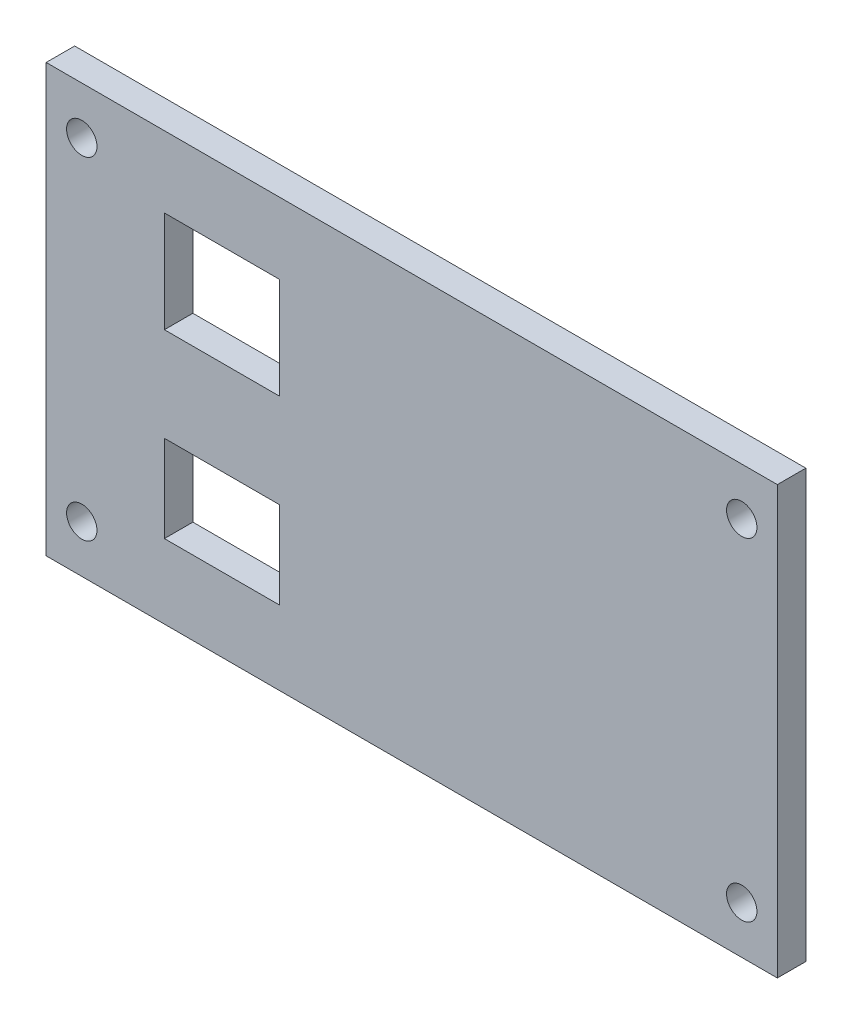
ISO-10303-21;
HEADER;
FILE_DESCRIPTION(('STEP AP214'),'2;1');
FILE_NAME('part.step','',(''),(''),'','','');
FILE_SCHEMA(('AUTOMOTIVE_DESIGN { 1 0 10303 214 1 1 1 1 }'));
ENDSEC;
DATA;
#1=APPLICATION_CONTEXT('core data for automotive mechanical design processes');
#2=APPLICATION_PROTOCOL_DEFINITION('international standard','automotive_design',2000,#1);
#3=PRODUCT_CONTEXT('',#1,'mechanical');
#4=PRODUCT('Part','Part','',(#3));
#5=PRODUCT_RELATED_PRODUCT_CATEGORY('part','',(#4));
#6=PRODUCT_DEFINITION_FORMATION('','',#4);
#7=PRODUCT_DEFINITION_CONTEXT('part definition',#1,'design');
#8=PRODUCT_DEFINITION('design','',#6,#7);
#9=PRODUCT_DEFINITION_SHAPE('','',#8);
#10=(LENGTH_UNIT() NAMED_UNIT(*) SI_UNIT(.MILLI.,.METRE.));
#11=(NAMED_UNIT(*) PLANE_ANGLE_UNIT() SI_UNIT($,.RADIAN.));
#12=(NAMED_UNIT(*) SI_UNIT($,.STERADIAN.) SOLID_ANGLE_UNIT());
#13=UNCERTAINTY_MEASURE_WITH_UNIT(LENGTH_MEASURE(1.E-05),#10,'distance_accuracy_value','');
#14=(GEOMETRIC_REPRESENTATION_CONTEXT(3) GLOBAL_UNCERTAINTY_ASSIGNED_CONTEXT((#13)) GLOBAL_UNIT_ASSIGNED_CONTEXT((#10,
#11,#12)) REPRESENTATION_CONTEXT('',''));
#15=CARTESIAN_POINT('',(0.,0.,0.));
#16=DIRECTION('',(0.,0.,1.));
#17=DIRECTION('',(1.,0.,0.));
#18=AXIS2_PLACEMENT_3D('',#15,#16,#17);
#19=CARTESIAN_POINT('',(-38.5,-22.5,3.));
#20=DIRECTION('',(1.,0.,0.));
#21=DIRECTION('',(0.,0.,-1.));
#22=AXIS2_PLACEMENT_3D('',#19,#20,#21);
#23=PLANE('',#22);
#24=DIRECTION('',(0.,-1.,0.));
#25=VECTOR('',#24,1.);
#26=CARTESIAN_POINT('',(-38.5,-22.5,0.));
#27=LINE('',#26,#25);
#28=CARTESIAN_POINT('',(-38.5,22.5,0.));
#29=VERTEX_POINT('',#28);
#30=CARTESIAN_POINT('',(-38.5,-22.5,0.));
#31=VERTEX_POINT('',#30);
#32=EDGE_CURVE('E186',#29,#31,#27,.T.);
#33=ORIENTED_EDGE('',*,*,#32,.T.);
#34=DIRECTION('',(0.,0.,-1.));
#35=VECTOR('',#34,1.);
#36=CARTESIAN_POINT('',(-38.5,-22.5,3.));
#37=LINE('',#36,#35);
#38=CARTESIAN_POINT('',(-38.5,-22.5,3.));
#39=VERTEX_POINT('',#38);
#40=EDGE_CURVE('E11',#39,#31,#37,.T.);
#41=ORIENTED_EDGE('',*,*,#40,.F.);
#42=DIRECTION('',(0.,-1.,0.));
#43=VECTOR('',#42,1.);
#44=CARTESIAN_POINT('',(-38.5,-22.5,3.));
#45=LINE('',#44,#43);
#46=CARTESIAN_POINT('',(-38.5,22.5,3.));
#47=VERTEX_POINT('',#46);
#48=EDGE_CURVE('E187',#47,#39,#45,.T.);
#49=ORIENTED_EDGE('',*,*,#48,.F.);
#50=DIRECTION('',(0.,0.,-1.));
#51=VECTOR('',#50,1.);
#52=CARTESIAN_POINT('',(-38.5,22.5,3.));
#53=LINE('',#52,#51);
#54=EDGE_CURVE('E197',#47,#29,#53,.T.);
#55=ORIENTED_EDGE('',*,*,#54,.T.);
#56=EDGE_LOOP('',(#33,#41,#49,#55));
#57=FACE_BOUND('',#56,.T.);
#58=ADVANCED_FACE('F32',(#57),#23,.F.);
#59=CARTESIAN_POINT('',(38.5,-22.5,3.));
#60=DIRECTION('',(0.,1.,0.));
#61=DIRECTION('',(-1.,0.,0.));
#62=AXIS2_PLACEMENT_3D('',#59,#60,#61);
#63=PLANE('',#62);
#64=DIRECTION('',(1.,0.,0.));
#65=VECTOR('',#64,1.);
#66=CARTESIAN_POINT('',(38.5,-22.5,0.));
#67=LINE('',#66,#65);
#68=CARTESIAN_POINT('',(38.5,-22.5,0.));
#69=VERTEX_POINT('',#68);
#70=EDGE_CURVE('E200',#31,#69,#67,.T.);
#71=ORIENTED_EDGE('',*,*,#70,.T.);
#72=DIRECTION('',(0.,0.,-1.));
#73=VECTOR('',#72,1.);
#74=CARTESIAN_POINT('',(38.5,-22.5,3.));
#75=LINE('',#74,#73);
#76=CARTESIAN_POINT('',(38.5,-22.5,3.));
#77=VERTEX_POINT('',#76);
#78=EDGE_CURVE('E39',#77,#69,#75,.T.);
#79=ORIENTED_EDGE('',*,*,#78,.F.);
#80=DIRECTION('',(1.,0.,0.));
#81=VECTOR('',#80,1.);
#82=CARTESIAN_POINT('',(38.5,-22.5,3.));
#83=LINE('',#82,#81);
#84=EDGE_CURVE('E190',#39,#77,#83,.T.);
#85=ORIENTED_EDGE('',*,*,#84,.F.);
#86=ORIENTED_EDGE('',*,*,#40,.T.);
#87=EDGE_LOOP('',(#71,#79,#85,#86));
#88=FACE_BOUND('',#87,.T.);
#89=ADVANCED_FACE('F229',(#88),#63,.F.);
#90=CARTESIAN_POINT('',(38.5,-22.5,3.));
#91=DIRECTION('',(-1.,0.,0.));
#92=DIRECTION('',(0.,0.,1.));
#93=AXIS2_PLACEMENT_3D('',#90,#91,#92);
#94=PLANE('',#93);
#95=DIRECTION('',(0.,1.,0.));
#96=VECTOR('',#95,1.);
#97=CARTESIAN_POINT('',(38.5,-22.5,0.));
#98=LINE('',#97,#96);
#99=CARTESIAN_POINT('',(38.5,22.5,0.));
#100=VERTEX_POINT('',#99);
#101=EDGE_CURVE('E202',#69,#100,#98,.T.);
#102=ORIENTED_EDGE('',*,*,#101,.T.);
#103=DIRECTION('',(0.,0.,-1.));
#104=VECTOR('',#103,1.);
#105=CARTESIAN_POINT('',(38.5,22.5,3.));
#106=LINE('',#105,#104);
#107=CARTESIAN_POINT('',(38.5,22.5,3.));
#108=VERTEX_POINT('',#107);
#109=EDGE_CURVE('E207',#108,#100,#106,.T.);
#110=ORIENTED_EDGE('',*,*,#109,.F.);
#111=DIRECTION('',(0.,1.,0.));
#112=VECTOR('',#111,1.);
#113=CARTESIAN_POINT('',(38.5,-22.5,3.));
#114=LINE('',#113,#112);
#115=EDGE_CURVE('E193',#77,#108,#114,.T.);
#116=ORIENTED_EDGE('',*,*,#115,.F.);
#117=ORIENTED_EDGE('',*,*,#78,.T.);
#118=EDGE_LOOP('',(#102,#110,#116,#117));
#119=FACE_BOUND('',#118,.T.);
#120=ADVANCED_FACE('F214',(#119),#94,.F.);
#121=CARTESIAN_POINT('',(38.5,22.5,3.));
#122=DIRECTION('',(0.,-1.,0.));
#123=DIRECTION('',(1.,0.,0.));
#124=AXIS2_PLACEMENT_3D('',#121,#122,#123);
#125=PLANE('',#124);
#126=DIRECTION('',(-1.,0.,0.));
#127=VECTOR('',#126,1.);
#128=CARTESIAN_POINT('',(38.5,22.5,0.));
#129=LINE('',#128,#127);
#130=EDGE_CURVE('E191',#100,#29,#129,.T.);
#131=ORIENTED_EDGE('',*,*,#130,.T.);
#132=ORIENTED_EDGE('',*,*,#54,.F.);
#133=DIRECTION('',(-1.,0.,0.));
#134=VECTOR('',#133,1.);
#135=CARTESIAN_POINT('',(38.5,22.5,3.));
#136=LINE('',#135,#134);
#137=EDGE_CURVE('E195',#108,#47,#136,.T.);
#138=ORIENTED_EDGE('',*,*,#137,.F.);
#139=ORIENTED_EDGE('',*,*,#109,.T.);
#140=EDGE_LOOP('',(#131,#132,#138,#139));
#141=FACE_BOUND('',#140,.T.);
#142=ADVANCED_FACE('F223',(#141),#125,.F.);
#143=CARTESIAN_POINT('',(-38.5,22.5,3.));
#144=DIRECTION('',(0.,0.,1.));
#145=DIRECTION('',(1.,0.,0.));
#146=AXIS2_PLACEMENT_3D('',#143,#144,#145);
#147=PLANE('',#146);
#148=CARTESIAN_POINT('',(-34.75,-17.5,3.));
#149=DIRECTION('',(0.,0.,1.));
#150=DIRECTION('',(1.,0.,0.));
#151=AXIS2_PLACEMENT_3D('',#148,#149,#150);
#152=CIRCLE('',#151,1.6);
#153=CARTESIAN_POINT('',(-33.15,-17.5,3.));
#154=VERTEX_POINT('',#153);
#155=EDGE_CURVE('E293',#154,#154,#152,.F.);
#156=ORIENTED_EDGE('',*,*,#155,.T.);
#157=EDGE_LOOP('',(#156));
#158=FACE_BOUND('',#157,.T.);
#159=CARTESIAN_POINT('',(34.75,-17.5,3.));
#160=DIRECTION('',(0.,0.,1.));
#161=DIRECTION('',(1.,0.,0.));
#162=AXIS2_PLACEMENT_3D('',#159,#160,#161);
#163=CIRCLE('',#162,1.6);
#164=CARTESIAN_POINT('',(36.35,-17.5,3.));
#165=VERTEX_POINT('',#164);
#166=EDGE_CURVE('E297',#165,#165,#163,.F.);
#167=ORIENTED_EDGE('',*,*,#166,.T.);
#168=EDGE_LOOP('',(#167));
#169=FACE_BOUND('',#168,.T.);
#170=CARTESIAN_POINT('',(34.75,17.5,3.));
#171=DIRECTION('',(0.,0.,1.));
#172=DIRECTION('',(1.,0.,0.));
#173=AXIS2_PLACEMENT_3D('',#170,#171,#172);
#174=CIRCLE('',#173,1.6);
#175=CARTESIAN_POINT('',(36.35,17.5,3.));
#176=VERTEX_POINT('',#175);
#177=EDGE_CURVE('E305',#176,#176,#174,.F.);
#178=ORIENTED_EDGE('',*,*,#177,.T.);
#179=EDGE_LOOP('',(#178));
#180=FACE_BOUND('',#179,.T.);
#181=CARTESIAN_POINT('',(-34.75,17.5,3.));
#182=DIRECTION('',(0.,0.,1.));
#183=DIRECTION('',(1.,0.,0.));
#184=AXIS2_PLACEMENT_3D('',#181,#182,#183);
#185=CIRCLE('',#184,1.6);
#186=CARTESIAN_POINT('',(-33.15,17.5,3.));
#187=VERTEX_POINT('',#186);
#188=EDGE_CURVE('E310',#187,#187,#185,.F.);
#189=ORIENTED_EDGE('',*,*,#188,.T.);
#190=EDGE_LOOP('',(#189));
#191=FACE_BOUND('',#190,.T.);
#192=DIRECTION('',(0.,1.,0.));
#193=VECTOR('',#192,1.);
#194=CARTESIAN_POINT('',(-26.05,-5.55,3.));
#195=LINE('',#194,#193);
#196=CARTESIAN_POINT('',(-26.05,-14.7,3.));
#197=VERTEX_POINT('',#196);
#198=CARTESIAN_POINT('',(-26.05,-5.55,3.));
#199=VERTEX_POINT('',#198);
#200=EDGE_CURVE('E130',#197,#199,#195,.T.);
#201=ORIENTED_EDGE('',*,*,#200,.T.);
#202=DIRECTION('',(1.,0.,0.));
#203=VECTOR('',#202,1.);
#204=CARTESIAN_POINT('',(-26.05,-5.55,3.));
#205=LINE('',#204,#203);
#206=CARTESIAN_POINT('',(-13.95,-5.55,3.));
#207=VERTEX_POINT('',#206);
#208=EDGE_CURVE('E119',#199,#207,#205,.T.);
#209=ORIENTED_EDGE('',*,*,#208,.T.);
#210=DIRECTION('',(0.,-1.,0.));
#211=VECTOR('',#210,1.);
#212=CARTESIAN_POINT('',(-13.95,-5.55,3.));
#213=LINE('',#212,#211);
#214=CARTESIAN_POINT('',(-13.95,-14.7,3.));
#215=VERTEX_POINT('',#214);
#216=EDGE_CURVE('E141',#207,#215,#213,.T.);
#217=ORIENTED_EDGE('',*,*,#216,.T.);
#218=DIRECTION('',(-1.,0.,0.));
#219=VECTOR('',#218,1.);
#220=CARTESIAN_POINT('',(-26.05,-14.7,3.));
#221=LINE('',#220,#219);
#222=EDGE_CURVE('E137',#215,#197,#221,.T.);
#223=ORIENTED_EDGE('',*,*,#222,.T.);
#224=EDGE_LOOP('',(#201,#209,#217,#223));
#225=FACE_BOUND('',#224,.T.);
#226=DIRECTION('',(0.,1.,0.));
#227=VECTOR('',#226,1.);
#228=CARTESIAN_POINT('',(-26.05,15.,3.));
#229=LINE('',#228,#227);
#230=CARTESIAN_POINT('',(-26.05,4.35,3.));
#231=VERTEX_POINT('',#230);
#232=CARTESIAN_POINT('',(-26.05,15.,3.));
#233=VERTEX_POINT('',#232);
#234=EDGE_CURVE('E160',#231,#233,#229,.T.);
#235=ORIENTED_EDGE('',*,*,#234,.T.);
#236=DIRECTION('',(1.,0.,0.));
#237=VECTOR('',#236,1.);
#238=CARTESIAN_POINT('',(-26.05,15.,3.));
#239=LINE('',#238,#237);
#240=CARTESIAN_POINT('',(-13.95,15.,3.));
#241=VERTEX_POINT('',#240);
#242=EDGE_CURVE('E177',#233,#241,#239,.T.);
#243=ORIENTED_EDGE('',*,*,#242,.T.);
#244=DIRECTION('',(0.,-1.,0.));
#245=VECTOR('',#244,1.);
#246=CARTESIAN_POINT('',(-13.95,15.,3.));
#247=LINE('',#246,#245);
#248=CARTESIAN_POINT('',(-13.95,4.35,3.));
#249=VERTEX_POINT('',#248);
#250=EDGE_CURVE('E126',#241,#249,#247,.T.);
#251=ORIENTED_EDGE('',*,*,#250,.T.);
#252=DIRECTION('',(-1.,0.,0.));
#253=VECTOR('',#252,1.);
#254=CARTESIAN_POINT('',(-26.05,4.35,3.));
#255=LINE('',#254,#253);
#256=EDGE_CURVE('E157',#249,#231,#255,.T.);
#257=ORIENTED_EDGE('',*,*,#256,.T.);
#258=EDGE_LOOP('',(#235,#243,#251,#257));
#259=FACE_BOUND('',#258,.T.);
#260=ORIENTED_EDGE('',*,*,#48,.T.);
#261=ORIENTED_EDGE('',*,*,#84,.T.);
#262=ORIENTED_EDGE('',*,*,#115,.T.);
#263=ORIENTED_EDGE('',*,*,#137,.T.);
#264=EDGE_LOOP('',(#260,#261,#262,#263));
#265=FACE_BOUND('',#264,.T.);
#266=ADVANCED_FACE('F135',(#158,#169,#180,#191,#225,#259,#265),#147,.T.);
#267=CARTESIAN_POINT('',(-38.5,22.5,0.));
#268=DIRECTION('',(0.,0.,1.));
#269=DIRECTION('',(1.,0.,0.));
#270=AXIS2_PLACEMENT_3D('',#267,#268,#269);
#271=PLANE('',#270);
#272=CARTESIAN_POINT('',(-34.75,-17.5,0.));
#273=DIRECTION('',(0.,0.,-1.));
#274=DIRECTION('',(-1.,0.,0.));
#275=AXIS2_PLACEMENT_3D('',#272,#273,#274);
#276=CIRCLE('',#275,1.6);
#277=CARTESIAN_POINT('',(-36.35,-17.5,0.));
#278=VERTEX_POINT('',#277);
#279=EDGE_CURVE('E296',#278,#278,#276,.T.);
#280=ORIENTED_EDGE('',*,*,#279,.F.);
#281=EDGE_LOOP('',(#280));
#282=FACE_BOUND('',#281,.T.);
#283=CARTESIAN_POINT('',(34.75,-17.5,0.));
#284=DIRECTION('',(0.,0.,-1.));
#285=DIRECTION('',(-1.,0.,0.));
#286=AXIS2_PLACEMENT_3D('',#283,#284,#285);
#287=CIRCLE('',#286,1.6);
#288=CARTESIAN_POINT('',(33.15,-17.5,0.));
#289=VERTEX_POINT('',#288);
#290=EDGE_CURVE('E300',#289,#289,#287,.T.);
#291=ORIENTED_EDGE('',*,*,#290,.F.);
#292=EDGE_LOOP('',(#291));
#293=FACE_BOUND('',#292,.T.);
#294=CARTESIAN_POINT('',(34.75,17.5,0.));
#295=DIRECTION('',(0.,0.,-1.));
#296=DIRECTION('',(-1.,0.,0.));
#297=AXIS2_PLACEMENT_3D('',#294,#295,#296);
#298=CIRCLE('',#297,1.6);
#299=CARTESIAN_POINT('',(33.15,17.5,0.));
#300=VERTEX_POINT('',#299);
#301=EDGE_CURVE('E307',#300,#300,#298,.T.);
#302=ORIENTED_EDGE('',*,*,#301,.F.);
#303=EDGE_LOOP('',(#302));
#304=FACE_BOUND('',#303,.T.);
#305=CARTESIAN_POINT('',(-34.75,17.5,0.));
#306=DIRECTION('',(0.,0.,-1.));
#307=DIRECTION('',(-1.,0.,0.));
#308=AXIS2_PLACEMENT_3D('',#305,#306,#307);
#309=CIRCLE('',#308,1.6);
#310=CARTESIAN_POINT('',(-36.35,17.5,0.));
#311=VERTEX_POINT('',#310);
#312=EDGE_CURVE('E313',#311,#311,#309,.T.);
#313=ORIENTED_EDGE('',*,*,#312,.F.);
#314=EDGE_LOOP('',(#313));
#315=FACE_BOUND('',#314,.T.);
#316=DIRECTION('',(1.,0.,0.));
#317=VECTOR('',#316,1.);
#318=CARTESIAN_POINT('',(-26.05,-5.55,0.));
#319=LINE('',#318,#317);
#320=CARTESIAN_POINT('',(-26.05,-5.55,0.));
#321=VERTEX_POINT('',#320);
#322=CARTESIAN_POINT('',(-13.95,-5.55,0.));
#323=VERTEX_POINT('',#322);
#324=EDGE_CURVE('E139',#321,#323,#319,.T.);
#325=ORIENTED_EDGE('',*,*,#324,.F.);
#326=DIRECTION('',(0.,1.,0.));
#327=VECTOR('',#326,1.);
#328=CARTESIAN_POINT('',(-26.05,-5.55,0.));
#329=LINE('',#328,#327);
#330=CARTESIAN_POINT('',(-26.05,-14.7,0.));
#331=VERTEX_POINT('',#330);
#332=EDGE_CURVE('E54',#331,#321,#329,.T.);
#333=ORIENTED_EDGE('',*,*,#332,.F.);
#334=DIRECTION('',(-1.,0.,0.));
#335=VECTOR('',#334,1.);
#336=CARTESIAN_POINT('',(-26.05,-14.7,0.));
#337=LINE('',#336,#335);
#338=CARTESIAN_POINT('',(-13.95,-14.7,0.));
#339=VERTEX_POINT('',#338);
#340=EDGE_CURVE('E132',#339,#331,#337,.T.);
#341=ORIENTED_EDGE('',*,*,#340,.F.);
#342=DIRECTION('',(0.,-1.,0.));
#343=VECTOR('',#342,1.);
#344=CARTESIAN_POINT('',(-13.95,-5.55,0.));
#345=LINE('',#344,#343);
#346=EDGE_CURVE('E146',#323,#339,#345,.T.);
#347=ORIENTED_EDGE('',*,*,#346,.F.);
#348=EDGE_LOOP('',(#325,#333,#341,#347));
#349=FACE_BOUND('',#348,.T.);
#350=DIRECTION('',(1.,0.,0.));
#351=VECTOR('',#350,1.);
#352=CARTESIAN_POINT('',(-26.05,15.,0.));
#353=LINE('',#352,#351);
#354=CARTESIAN_POINT('',(-26.05,15.,0.));
#355=VERTEX_POINT('',#354);
#356=CARTESIAN_POINT('',(-13.95,15.,0.));
#357=VERTEX_POINT('',#356);
#358=EDGE_CURVE('E165',#355,#357,#353,.T.);
#359=ORIENTED_EDGE('',*,*,#358,.F.);
#360=DIRECTION('',(0.,1.,0.));
#361=VECTOR('',#360,1.);
#362=CARTESIAN_POINT('',(-26.05,15.,0.));
#363=LINE('',#362,#361);
#364=CARTESIAN_POINT('',(-26.05,4.35,0.));
#365=VERTEX_POINT('',#364);
#366=EDGE_CURVE('E163',#365,#355,#363,.T.);
#367=ORIENTED_EDGE('',*,*,#366,.F.);
#368=DIRECTION('',(-1.,0.,0.));
#369=VECTOR('',#368,1.);
#370=CARTESIAN_POINT('',(-26.05,4.35,0.));
#371=LINE('',#370,#369);
#372=CARTESIAN_POINT('',(-13.95,4.35,0.));
#373=VERTEX_POINT('',#372);
#374=EDGE_CURVE('E171',#373,#365,#371,.T.);
#375=ORIENTED_EDGE('',*,*,#374,.F.);
#376=DIRECTION('',(0.,-1.,0.));
#377=VECTOR('',#376,1.);
#378=CARTESIAN_POINT('',(-13.95,15.,0.));
#379=LINE('',#378,#377);
#380=EDGE_CURVE('E168',#357,#373,#379,.T.);
#381=ORIENTED_EDGE('',*,*,#380,.F.);
#382=EDGE_LOOP('',(#359,#367,#375,#381));
#383=FACE_BOUND('',#382,.T.);
#384=ORIENTED_EDGE('',*,*,#32,.F.);
#385=ORIENTED_EDGE('',*,*,#130,.F.);
#386=ORIENTED_EDGE('',*,*,#101,.F.);
#387=ORIENTED_EDGE('',*,*,#70,.F.);
#388=EDGE_LOOP('',(#384,#385,#386,#387));
#389=FACE_BOUND('',#388,.T.);
#390=ADVANCED_FACE('F220',(#282,#293,#304,#315,#349,#383,#389),#271,.F.);
#391=CARTESIAN_POINT('',(-26.05,15.,3.001));
#392=DIRECTION('',(-1.,0.,0.));
#393=DIRECTION('',(0.,0.,1.));
#394=AXIS2_PLACEMENT_3D('',#391,#392,#393);
#395=PLANE('',#394);
#396=DIRECTION('',(0.,0.,-1.));
#397=VECTOR('',#396,1.);
#398=CARTESIAN_POINT('',(-26.05,4.35,3.001));
#399=LINE('',#398,#397);
#400=EDGE_CURVE('E175',#231,#365,#399,.T.);
#401=ORIENTED_EDGE('',*,*,#400,.T.);
#402=ORIENTED_EDGE('',*,*,#366,.T.);
#403=DIRECTION('',(0.,0.,-1.));
#404=VECTOR('',#403,1.);
#405=CARTESIAN_POINT('',(-26.05,15.,3.001));
#406=LINE('',#405,#404);
#407=EDGE_CURVE('E174',#233,#355,#406,.T.);
#408=ORIENTED_EDGE('',*,*,#407,.F.);
#409=ORIENTED_EDGE('',*,*,#234,.F.);
#410=EDGE_LOOP('',(#401,#402,#408,#409));
#411=FACE_BOUND('',#410,.T.);
#412=ADVANCED_FACE('F241',(#411),#395,.F.);
#413=CARTESIAN_POINT('',(-26.05,4.35,3.001));
#414=DIRECTION('',(0.,-1.,0.));
#415=DIRECTION('',(1.,0.,0.));
#416=AXIS2_PLACEMENT_3D('',#413,#414,#415);
#417=PLANE('',#416);
#418=DIRECTION('',(0.,0.,-1.));
#419=VECTOR('',#418,1.);
#420=CARTESIAN_POINT('',(-13.95,4.35,3.001));
#421=LINE('',#420,#419);
#422=EDGE_CURVE('E178',#249,#373,#421,.T.);
#423=ORIENTED_EDGE('',*,*,#422,.T.);
#424=ORIENTED_EDGE('',*,*,#374,.T.);
#425=ORIENTED_EDGE('',*,*,#400,.F.);
#426=ORIENTED_EDGE('',*,*,#256,.F.);
#427=EDGE_LOOP('',(#423,#424,#425,#426));
#428=FACE_BOUND('',#427,.T.);
#429=ADVANCED_FACE('F248',(#428),#417,.F.);
#430=CARTESIAN_POINT('',(-13.95,15.,3.001));
#431=DIRECTION('',(1.,0.,0.));
#432=DIRECTION('',(0.,0.,-1.));
#433=AXIS2_PLACEMENT_3D('',#430,#431,#432);
#434=PLANE('',#433);
#435=DIRECTION('',(0.,0.,-1.));
#436=VECTOR('',#435,1.);
#437=CARTESIAN_POINT('',(-13.95,15.,3.001));
#438=LINE('',#437,#436);
#439=EDGE_CURVE('E180',#241,#357,#438,.T.);
#440=ORIENTED_EDGE('',*,*,#439,.T.);
#441=ORIENTED_EDGE('',*,*,#380,.T.);
#442=ORIENTED_EDGE('',*,*,#422,.F.);
#443=ORIENTED_EDGE('',*,*,#250,.F.);
#444=EDGE_LOOP('',(#440,#441,#442,#443));
#445=FACE_BOUND('',#444,.T.);
#446=ADVANCED_FACE('F253',(#445),#434,.F.);
#447=CARTESIAN_POINT('',(-26.05,15.,3.001));
#448=DIRECTION('',(0.,1.,0.));
#449=DIRECTION('',(-1.,0.,0.));
#450=AXIS2_PLACEMENT_3D('',#447,#448,#449);
#451=PLANE('',#450);
#452=ORIENTED_EDGE('',*,*,#407,.T.);
#453=ORIENTED_EDGE('',*,*,#358,.T.);
#454=ORIENTED_EDGE('',*,*,#439,.F.);
#455=ORIENTED_EDGE('',*,*,#242,.F.);
#456=EDGE_LOOP('',(#452,#453,#454,#455));
#457=FACE_BOUND('',#456,.T.);
#458=ADVANCED_FACE('F250',(#457),#451,.F.);
#459=CARTESIAN_POINT('',(-26.05,-5.55,3.001));
#460=DIRECTION('',(-1.,0.,0.));
#461=DIRECTION('',(0.,0.,1.));
#462=AXIS2_PLACEMENT_3D('',#459,#460,#461);
#463=PLANE('',#462);
#464=DIRECTION('',(0.,0.,-1.));
#465=VECTOR('',#464,1.);
#466=CARTESIAN_POINT('',(-26.05,-14.7,3.001));
#467=LINE('',#466,#465);
#468=EDGE_CURVE('E127',#197,#331,#467,.T.);
#469=ORIENTED_EDGE('',*,*,#468,.T.);
#470=ORIENTED_EDGE('',*,*,#332,.T.);
#471=DIRECTION('',(0.,0.,-1.));
#472=VECTOR('',#471,1.);
#473=CARTESIAN_POINT('',(-26.05,-5.55,3.001));
#474=LINE('',#473,#472);
#475=EDGE_CURVE('E121',#199,#321,#474,.T.);
#476=ORIENTED_EDGE('',*,*,#475,.F.);
#477=ORIENTED_EDGE('',*,*,#200,.F.);
#478=EDGE_LOOP('',(#469,#470,#476,#477));
#479=FACE_BOUND('',#478,.T.);
#480=ADVANCED_FACE('F129',(#479),#463,.F.);
#481=CARTESIAN_POINT('',(-26.05,-14.7,3.001));
#482=DIRECTION('',(0.,-1.,0.));
#483=DIRECTION('',(1.,0.,0.));
#484=AXIS2_PLACEMENT_3D('',#481,#482,#483);
#485=PLANE('',#484);
#486=DIRECTION('',(0.,0.,-1.));
#487=VECTOR('',#486,1.);
#488=CARTESIAN_POINT('',(-13.95,-14.7,3.001));
#489=LINE('',#488,#487);
#490=EDGE_CURVE('E152',#215,#339,#489,.T.);
#491=ORIENTED_EDGE('',*,*,#490,.T.);
#492=ORIENTED_EDGE('',*,*,#340,.T.);
#493=ORIENTED_EDGE('',*,*,#468,.F.);
#494=ORIENTED_EDGE('',*,*,#222,.F.);
#495=EDGE_LOOP('',(#491,#492,#493,#494));
#496=FACE_BOUND('',#495,.T.);
#497=ADVANCED_FACE('F263',(#496),#485,.F.);
#498=CARTESIAN_POINT('',(-13.95,-5.55,3.001));
#499=DIRECTION('',(1.,0.,0.));
#500=DIRECTION('',(0.,1.,0.));
#501=AXIS2_PLACEMENT_3D('',#498,#499,#500);
#502=PLANE('',#501);
#503=DIRECTION('',(0.,0.,-1.));
#504=VECTOR('',#503,1.);
#505=CARTESIAN_POINT('',(-13.95,-5.55,3.001));
#506=LINE('',#505,#504);
#507=EDGE_CURVE('E46',#207,#323,#506,.T.);
#508=ORIENTED_EDGE('',*,*,#507,.T.);
#509=ORIENTED_EDGE('',*,*,#346,.T.);
#510=ORIENTED_EDGE('',*,*,#490,.F.);
#511=ORIENTED_EDGE('',*,*,#216,.F.);
#512=EDGE_LOOP('',(#508,#509,#510,#511));
#513=FACE_BOUND('',#512,.T.);
#514=ADVANCED_FACE('F267',(#513),#502,.F.);
#515=CARTESIAN_POINT('',(-26.05,-5.55,3.001));
#516=DIRECTION('',(0.,1.,0.));
#517=DIRECTION('',(-1.,0.,0.));
#518=AXIS2_PLACEMENT_3D('',#515,#516,#517);
#519=PLANE('',#518);
#520=ORIENTED_EDGE('',*,*,#475,.T.);
#521=ORIENTED_EDGE('',*,*,#324,.T.);
#522=ORIENTED_EDGE('',*,*,#507,.F.);
#523=ORIENTED_EDGE('',*,*,#208,.F.);
#524=EDGE_LOOP('',(#520,#521,#522,#523));
#525=FACE_BOUND('',#524,.T.);
#526=ADVANCED_FACE('F120',(#525),#519,.F.);
#527=CARTESIAN_POINT('',(-34.75,17.5,3.001));
#528=DIRECTION('',(0.,0.,-1.));
#529=DIRECTION('',(-1.,0.,0.));
#530=AXIS2_PLACEMENT_3D('',#527,#528,#529);
#531=CYLINDRICAL_SURFACE('',#530,1.6);
#532=ORIENTED_EDGE('',*,*,#188,.F.);
#533=EDGE_LOOP('',(#532));
#534=FACE_BOUND('',#533,.T.);
#535=ORIENTED_EDGE('',*,*,#312,.T.);
#536=EDGE_LOOP('',(#535));
#537=FACE_BOUND('',#536,.T.);
#538=ADVANCED_FACE('F266',(#534,#537),#531,.F.);
#539=CARTESIAN_POINT('',(34.75,17.5,3.001));
#540=DIRECTION('',(0.,0.,-1.));
#541=DIRECTION('',(-1.,0.,0.));
#542=AXIS2_PLACEMENT_3D('',#539,#540,#541);
#543=CYLINDRICAL_SURFACE('',#542,1.6);
#544=ORIENTED_EDGE('',*,*,#177,.F.);
#545=EDGE_LOOP('',(#544));
#546=FACE_BOUND('',#545,.T.);
#547=ORIENTED_EDGE('',*,*,#301,.T.);
#548=EDGE_LOOP('',(#547));
#549=FACE_BOUND('',#548,.T.);
#550=ADVANCED_FACE('F276',(#546,#549),#543,.F.);
#551=CARTESIAN_POINT('',(34.75,-17.5,3.001));
#552=DIRECTION('',(0.,0.,-1.));
#553=DIRECTION('',(-1.,0.,0.));
#554=AXIS2_PLACEMENT_3D('',#551,#552,#553);
#555=CYLINDRICAL_SURFACE('',#554,1.6);
#556=ORIENTED_EDGE('',*,*,#166,.F.);
#557=EDGE_LOOP('',(#556));
#558=FACE_BOUND('',#557,.T.);
#559=ORIENTED_EDGE('',*,*,#290,.T.);
#560=EDGE_LOOP('',(#559));
#561=FACE_BOUND('',#560,.T.);
#562=ADVANCED_FACE('F280',(#558,#561),#555,.F.);
#563=CARTESIAN_POINT('',(-34.75,-17.5,3.001));
#564=DIRECTION('',(0.,0.,-1.));
#565=DIRECTION('',(-1.,0.,0.));
#566=AXIS2_PLACEMENT_3D('',#563,#564,#565);
#567=CYLINDRICAL_SURFACE('',#566,1.6);
#568=ORIENTED_EDGE('',*,*,#155,.F.);
#569=EDGE_LOOP('',(#568));
#570=FACE_BOUND('',#569,.T.);
#571=ORIENTED_EDGE('',*,*,#279,.T.);
#572=EDGE_LOOP('',(#571));
#573=FACE_BOUND('',#572,.T.);
#574=ADVANCED_FACE('F284',(#570,#573),#567,.F.);
#575=CLOSED_SHELL('',(#58,#89,#120,#142,#266,#390,#412,#429,#446,#458,#480,#497,#514,#526,#538,
#550,#562,#574));
#576=MANIFOLD_SOLID_BREP('B2',#575);
#577=ADVANCED_BREP_SHAPE_REPRESENTATION('',(#18,#576),#14);
#578=SHAPE_DEFINITION_REPRESENTATION(#9,#577);
ENDSEC;
END-ISO-10303-21;
